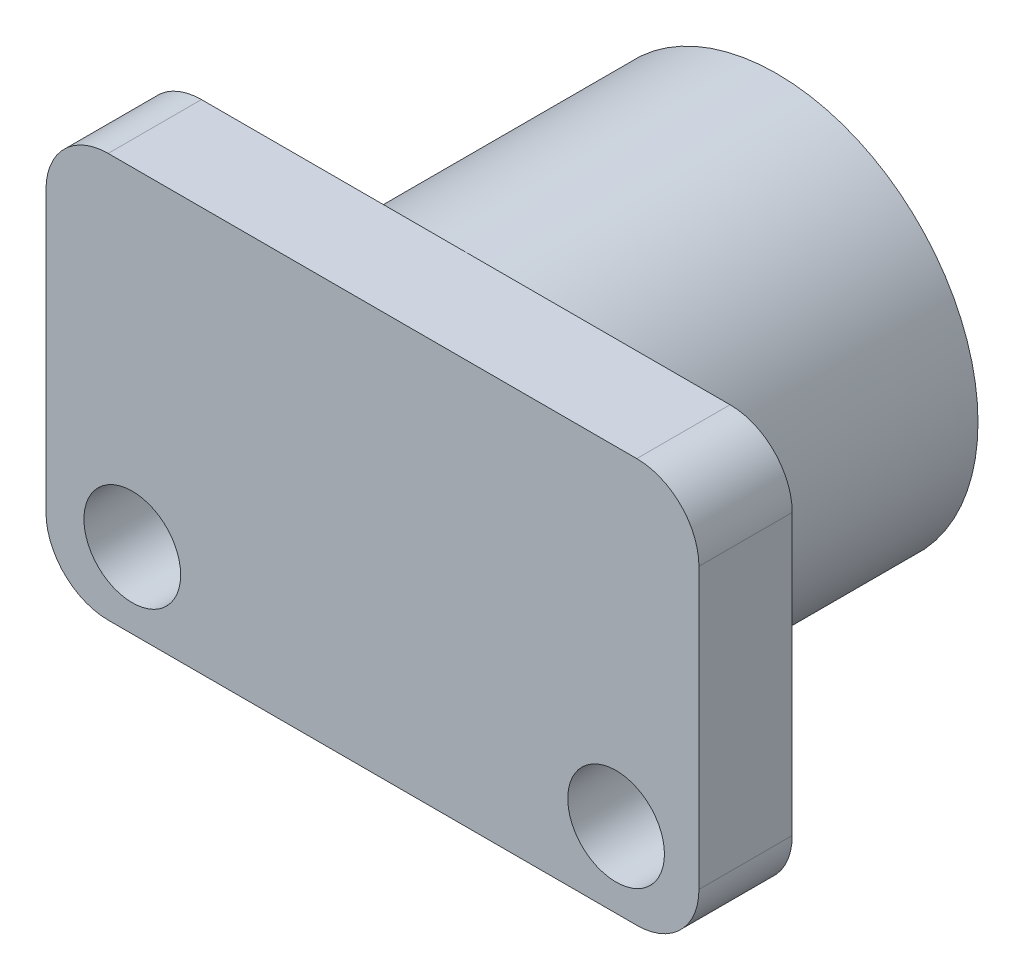
ISO-10303-21;
HEADER;
FILE_DESCRIPTION(('STEP AP214'),'2;1');
FILE_NAME('part.step','',(''),(''),'','','');
FILE_SCHEMA(('AUTOMOTIVE_DESIGN { 1 0 10303 214 1 1 1 1 }'));
ENDSEC;
DATA;
#1=APPLICATION_CONTEXT('core data for automotive mechanical design processes');
#2=APPLICATION_PROTOCOL_DEFINITION('international standard','automotive_design',2000,#1);
#3=PRODUCT_CONTEXT('',#1,'mechanical');
#4=PRODUCT('Part','Part','',(#3));
#5=PRODUCT_RELATED_PRODUCT_CATEGORY('part','',(#4));
#6=PRODUCT_DEFINITION_FORMATION('','',#4);
#7=PRODUCT_DEFINITION_CONTEXT('part definition',#1,'design');
#8=PRODUCT_DEFINITION('design','',#6,#7);
#9=PRODUCT_DEFINITION_SHAPE('','',#8);
#10=(LENGTH_UNIT() NAMED_UNIT(*) SI_UNIT(.MILLI.,.METRE.));
#11=(NAMED_UNIT(*) PLANE_ANGLE_UNIT() SI_UNIT($,.RADIAN.));
#12=(NAMED_UNIT(*) SI_UNIT($,.STERADIAN.) SOLID_ANGLE_UNIT());
#13=UNCERTAINTY_MEASURE_WITH_UNIT(LENGTH_MEASURE(1.E-05),#10,'distance_accuracy_value','');
#14=(GEOMETRIC_REPRESENTATION_CONTEXT(3) GLOBAL_UNCERTAINTY_ASSIGNED_CONTEXT((#13)) GLOBAL_UNIT_ASSIGNED_CONTEXT((#10,
#11,#12)) REPRESENTATION_CONTEXT('',''));
#15=CARTESIAN_POINT('',(0.,0.,0.));
#16=DIRECTION('',(0.,0.,1.));
#17=DIRECTION('',(1.,0.,0.));
#18=AXIS2_PLACEMENT_3D('',#15,#16,#17);
#19=CARTESIAN_POINT('',(-10.5,-6.5,3.));
#20=DIRECTION('',(1.,0.,0.));
#21=DIRECTION('',(0.,0.,-1.));
#22=AXIS2_PLACEMENT_3D('',#19,#20,#21);
#23=PLANE('',#22);
#24=DIRECTION('',(0.,-1.,0.));
#25=VECTOR('',#24,1.);
#26=CARTESIAN_POINT('',(-10.5,-6.5,0.));
#27=LINE('',#26,#25);
#28=CARTESIAN_POINT('',(-10.5,4.5,0.));
#29=VERTEX_POINT('',#28);
#30=CARTESIAN_POINT('',(-10.5,-4.5,0.));
#31=VERTEX_POINT('',#30);
#32=EDGE_CURVE('E132',#29,#31,#27,.T.);
#33=ORIENTED_EDGE('',*,*,#32,.T.);
#34=DIRECTION('',(0.,0.,-1.));
#35=VECTOR('',#34,1.);
#36=CARTESIAN_POINT('',(-10.5,-4.5,3.));
#37=LINE('',#36,#35);
#38=CARTESIAN_POINT('',(-10.5,-4.5,3.));
#39=VERTEX_POINT('',#38);
#40=EDGE_CURVE('E110',#31,#39,#37,.F.);
#41=ORIENTED_EDGE('',*,*,#40,.T.);
#42=DIRECTION('',(0.,-1.,0.));
#43=VECTOR('',#42,1.);
#44=CARTESIAN_POINT('',(-10.5,-6.5,3.));
#45=LINE('',#44,#43);
#46=CARTESIAN_POINT('',(-10.5,4.5,3.));
#47=VERTEX_POINT('',#46);
#48=EDGE_CURVE('E142',#47,#39,#45,.T.);
#49=ORIENTED_EDGE('',*,*,#48,.F.);
#50=DIRECTION('',(0.,0.,-1.));
#51=VECTOR('',#50,1.);
#52=CARTESIAN_POINT('',(-10.5,4.5,3.));
#53=LINE('',#52,#51);
#54=EDGE_CURVE('E115',#47,#29,#53,.T.);
#55=ORIENTED_EDGE('',*,*,#54,.T.);
#56=EDGE_LOOP('',(#33,#41,#49,#55));
#57=FACE_BOUND('',#56,.T.);
#58=ADVANCED_FACE('F38',(#57),#23,.F.);
#59=CARTESIAN_POINT('',(10.5,-6.5,3.));
#60=DIRECTION('',(0.,1.,0.));
#61=DIRECTION('',(-1.,0.,0.));
#62=AXIS2_PLACEMENT_3D('',#59,#60,#61);
#63=PLANE('',#62);
#64=DIRECTION('',(1.,0.,0.));
#65=VECTOR('',#64,1.);
#66=CARTESIAN_POINT('',(10.5,-6.5,3.));
#67=LINE('',#66,#65);
#68=CARTESIAN_POINT('',(-8.49999999999999,-6.5,3.));
#69=VERTEX_POINT('',#68);
#70=CARTESIAN_POINT('',(8.5,-6.5,3.));
#71=VERTEX_POINT('',#70);
#72=EDGE_CURVE('E125',#69,#71,#67,.T.);
#73=ORIENTED_EDGE('',*,*,#72,.F.);
#74=DIRECTION('',(0.,0.,-1.));
#75=VECTOR('',#74,1.);
#76=CARTESIAN_POINT('',(-8.5,-6.5,3.));
#77=LINE('',#76,#75);
#78=CARTESIAN_POINT('',(-8.49999999999999,-6.5,0.));
#79=VERTEX_POINT('',#78);
#80=EDGE_CURVE('E109',#69,#79,#77,.T.);
#81=ORIENTED_EDGE('',*,*,#80,.T.);
#82=DIRECTION('',(1.,0.,0.));
#83=VECTOR('',#82,1.);
#84=CARTESIAN_POINT('',(10.5,-6.5,0.));
#85=LINE('',#84,#83);
#86=CARTESIAN_POINT('',(8.5,-6.5,0.));
#87=VERTEX_POINT('',#86);
#88=EDGE_CURVE('E122',#79,#87,#85,.T.);
#89=ORIENTED_EDGE('',*,*,#88,.T.);
#90=DIRECTION('',(0.,0.,-1.));
#91=VECTOR('',#90,1.);
#92=CARTESIAN_POINT('',(8.5,-6.5,3.));
#93=LINE('',#92,#91);
#94=EDGE_CURVE('E127',#87,#71,#93,.F.);
#95=ORIENTED_EDGE('',*,*,#94,.T.);
#96=EDGE_LOOP('',(#73,#81,#89,#95));
#97=FACE_BOUND('',#96,.T.);
#98=ADVANCED_FACE('F121',(#97),#63,.F.);
#99=CARTESIAN_POINT('',(10.5,-6.5,3.));
#100=DIRECTION('',(-1.,0.,0.));
#101=DIRECTION('',(0.,0.,1.));
#102=AXIS2_PLACEMENT_3D('',#99,#100,#101);
#103=PLANE('',#102);
#104=DIRECTION('',(0.,1.,0.));
#105=VECTOR('',#104,1.);
#106=CARTESIAN_POINT('',(10.5,-6.5,3.));
#107=LINE('',#106,#105);
#108=CARTESIAN_POINT('',(10.5,-4.5,3.));
#109=VERTEX_POINT('',#108);
#110=CARTESIAN_POINT('',(10.5,4.5,3.));
#111=VERTEX_POINT('',#110);
#112=EDGE_CURVE('E176',#109,#111,#107,.T.);
#113=ORIENTED_EDGE('',*,*,#112,.F.);
#114=DIRECTION('',(0.,0.,-1.));
#115=VECTOR('',#114,1.);
#116=CARTESIAN_POINT('',(10.5,-4.5,3.));
#117=LINE('',#116,#115);
#118=CARTESIAN_POINT('',(10.5,-4.5,0.));
#119=VERTEX_POINT('',#118);
#120=EDGE_CURVE('E161',#109,#119,#117,.T.);
#121=ORIENTED_EDGE('',*,*,#120,.T.);
#122=DIRECTION('',(0.,1.,0.));
#123=VECTOR('',#122,1.);
#124=CARTESIAN_POINT('',(10.5,-6.5,0.));
#125=LINE('',#124,#123);
#126=CARTESIAN_POINT('',(10.5,4.5,0.));
#127=VERTEX_POINT('',#126);
#128=EDGE_CURVE('E131',#119,#127,#125,.T.);
#129=ORIENTED_EDGE('',*,*,#128,.T.);
#130=DIRECTION('',(0.,0.,-1.));
#131=VECTOR('',#130,1.);
#132=CARTESIAN_POINT('',(10.5,4.5,3.));
#133=LINE('',#132,#131);
#134=EDGE_CURVE('E159',#127,#111,#133,.F.);
#135=ORIENTED_EDGE('',*,*,#134,.T.);
#136=EDGE_LOOP('',(#113,#121,#129,#135));
#137=FACE_BOUND('',#136,.T.);
#138=ADVANCED_FACE('F192',(#137),#103,.F.);
#139=CARTESIAN_POINT('',(10.5,6.5,3.));
#140=DIRECTION('',(0.,-1.,0.));
#141=DIRECTION('',(1.,0.,0.));
#142=AXIS2_PLACEMENT_3D('',#139,#140,#141);
#143=PLANE('',#142);
#144=DIRECTION('',(-1.,0.,0.));
#145=VECTOR('',#144,1.);
#146=CARTESIAN_POINT('',(10.5,6.5,3.));
#147=LINE('',#146,#145);
#148=CARTESIAN_POINT('',(8.5,6.5,3.));
#149=VERTEX_POINT('',#148);
#150=CARTESIAN_POINT('',(-8.49999999999999,6.5,3.));
#151=VERTEX_POINT('',#150);
#152=EDGE_CURVE('E143',#149,#151,#147,.T.);
#153=ORIENTED_EDGE('',*,*,#152,.F.);
#154=DIRECTION('',(0.,0.,-1.));
#155=VECTOR('',#154,1.);
#156=CARTESIAN_POINT('',(8.5,6.5,3.));
#157=LINE('',#156,#155);
#158=CARTESIAN_POINT('',(8.5,6.5,0.));
#159=VERTEX_POINT('',#158);
#160=EDGE_CURVE('E46',#149,#159,#157,.T.);
#161=ORIENTED_EDGE('',*,*,#160,.T.);
#162=DIRECTION('',(-1.,0.,0.));
#163=VECTOR('',#162,1.);
#164=CARTESIAN_POINT('',(10.5,6.5,0.));
#165=LINE('',#164,#163);
#166=CARTESIAN_POINT('',(-8.49999999999999,6.5,0.));
#167=VERTEX_POINT('',#166);
#168=EDGE_CURVE('E135',#159,#167,#165,.T.);
#169=ORIENTED_EDGE('',*,*,#168,.T.);
#170=DIRECTION('',(0.,0.,-1.));
#171=VECTOR('',#170,1.);
#172=CARTESIAN_POINT('',(-8.5,6.5,3.));
#173=LINE('',#172,#171);
#174=EDGE_CURVE('E53',#167,#151,#173,.F.);
#175=ORIENTED_EDGE('',*,*,#174,.T.);
#176=EDGE_LOOP('',(#153,#161,#169,#175));
#177=FACE_BOUND('',#176,.T.);
#178=ADVANCED_FACE('F167',(#177),#143,.F.);
#179=CARTESIAN_POINT('',(0.,0.,3.));
#180=DIRECTION('',(0.,0.,1.));
#181=DIRECTION('',(1.,0.,0.));
#182=AXIS2_PLACEMENT_3D('',#179,#180,#181);
#183=PLANE('',#182);
#184=CARTESIAN_POINT('',(-7.725,-4.07406947421162,3.));
#185=DIRECTION('',(0.,0.,1.));
#186=DIRECTION('',(1.,0.,0.));
#187=AXIS2_PLACEMENT_3D('',#184,#185,#186);
#188=CIRCLE('',#187,1.555);
#189=CARTESIAN_POINT('',(-6.17,-4.07406947421162,3.));
#190=VERTEX_POINT('',#189);
#191=EDGE_CURVE('E337',#190,#190,#188,.T.);
#192=ORIENTED_EDGE('',*,*,#191,.F.);
#193=EDGE_LOOP('',(#192));
#194=FACE_BOUND('',#193,.T.);
#195=CARTESIAN_POINT('',(7.835,-4.07406947421162,3.));
#196=DIRECTION('',(0.,0.,1.));
#197=DIRECTION('',(1.,0.,0.));
#198=AXIS2_PLACEMENT_3D('',#195,#196,#197);
#199=CIRCLE('',#198,1.555);
#200=CARTESIAN_POINT('',(9.39,-4.07406947421162,3.));
#201=VERTEX_POINT('',#200);
#202=EDGE_CURVE('E179',#201,#201,#199,.T.);
#203=ORIENTED_EDGE('',*,*,#202,.F.);
#204=EDGE_LOOP('',(#203));
#205=FACE_BOUND('',#204,.T.);
#206=ORIENTED_EDGE('',*,*,#48,.T.);
#207=CARTESIAN_POINT('',(-8.5,-4.5,3.));
#208=DIRECTION('',(0.,0.,1.));
#209=DIRECTION('',(1.,0.,0.));
#210=AXIS2_PLACEMENT_3D('',#207,#208,#209);
#211=CIRCLE('',#210,2.);
#212=EDGE_CURVE('E157',#39,#69,#211,.T.);
#213=ORIENTED_EDGE('',*,*,#212,.T.);
#214=ORIENTED_EDGE('',*,*,#72,.T.);
#215=CARTESIAN_POINT('',(8.5,-4.5,3.));
#216=DIRECTION('',(0.,0.,1.));
#217=DIRECTION('',(1.,0.,0.));
#218=AXIS2_PLACEMENT_3D('',#215,#216,#217);
#219=CIRCLE('',#218,2.);
#220=EDGE_CURVE('E155',#71,#109,#219,.T.);
#221=ORIENTED_EDGE('',*,*,#220,.T.);
#222=ORIENTED_EDGE('',*,*,#112,.T.);
#223=CARTESIAN_POINT('',(8.5,4.5,3.));
#224=DIRECTION('',(0.,0.,1.));
#225=DIRECTION('',(1.,0.,0.));
#226=AXIS2_PLACEMENT_3D('',#223,#224,#225);
#227=CIRCLE('',#226,2.);
#228=EDGE_CURVE('E60',#111,#149,#227,.T.);
#229=ORIENTED_EDGE('',*,*,#228,.T.);
#230=ORIENTED_EDGE('',*,*,#152,.T.);
#231=CARTESIAN_POINT('',(-8.5,4.5,3.));
#232=DIRECTION('',(0.,0.,1.));
#233=DIRECTION('',(1.,0.,0.));
#234=AXIS2_PLACEMENT_3D('',#231,#232,#233);
#235=CIRCLE('',#234,2.);
#236=EDGE_CURVE('E152',#151,#47,#235,.T.);
#237=ORIENTED_EDGE('',*,*,#236,.T.);
#238=EDGE_LOOP('',(#206,#213,#214,#221,#222,#229,#230,#237));
#239=FACE_BOUND('',#238,.T.);
#240=ADVANCED_FACE('F182',(#194,#205,#239),#183,.T.);
#241=CARTESIAN_POINT('',(0.,0.,0.));
#242=DIRECTION('',(0.,0.,1.));
#243=DIRECTION('',(1.,0.,0.));
#244=AXIS2_PLACEMENT_3D('',#241,#242,#243);
#245=PLANE('',#244);
#246=CARTESIAN_POINT('',(0.,0.,0.));
#247=DIRECTION('',(0.,0.,1.));
#248=DIRECTION('',(1.,0.,0.));
#249=AXIS2_PLACEMENT_3D('',#246,#247,#248);
#250=CIRCLE('',#249,6.475);
#251=CARTESIAN_POINT('',(6.475,0.,0.));
#252=VERTEX_POINT('',#251);
#253=EDGE_CURVE('E11',#252,#252,#250,.F.);
#254=ORIENTED_EDGE('',*,*,#253,.F.);
#255=EDGE_LOOP('',(#254));
#256=FACE_BOUND('',#255,.T.);
#257=CARTESIAN_POINT('',(-7.725,-4.07406947421162,0.));
#258=DIRECTION('',(0.,0.,1.));
#259=DIRECTION('',(1.,0.,0.));
#260=AXIS2_PLACEMENT_3D('',#257,#258,#259);
#261=CIRCLE('',#260,1.555);
#262=CARTESIAN_POINT('',(-6.17,-4.07406947421162,0.));
#263=VERTEX_POINT('',#262);
#264=EDGE_CURVE('E137',#263,#263,#261,.T.);
#265=ORIENTED_EDGE('',*,*,#264,.T.);
#266=EDGE_LOOP('',(#265));
#267=FACE_BOUND('',#266,.T.);
#268=CARTESIAN_POINT('',(7.835,-4.07406947421162,0.));
#269=DIRECTION('',(0.,0.,1.));
#270=DIRECTION('',(1.,0.,0.));
#271=AXIS2_PLACEMENT_3D('',#268,#269,#270);
#272=CIRCLE('',#271,1.555);
#273=CARTESIAN_POINT('',(9.39,-4.07406947421162,0.));
#274=VERTEX_POINT('',#273);
#275=EDGE_CURVE('E339',#274,#274,#272,.T.);
#276=ORIENTED_EDGE('',*,*,#275,.T.);
#277=EDGE_LOOP('',(#276));
#278=FACE_BOUND('',#277,.T.);
#279=ORIENTED_EDGE('',*,*,#88,.F.);
#280=CARTESIAN_POINT('',(-8.5,-4.5,0.));
#281=DIRECTION('',(0.,0.,1.));
#282=DIRECTION('',(1.,0.,0.));
#283=AXIS2_PLACEMENT_3D('',#280,#281,#282);
#284=CIRCLE('',#283,2.);
#285=EDGE_CURVE('E105',#79,#31,#284,.F.);
#286=ORIENTED_EDGE('',*,*,#285,.T.);
#287=ORIENTED_EDGE('',*,*,#32,.F.);
#288=CARTESIAN_POINT('',(-8.5,4.5,0.));
#289=DIRECTION('',(0.,0.,1.));
#290=DIRECTION('',(1.,0.,0.));
#291=AXIS2_PLACEMENT_3D('',#288,#289,#290);
#292=CIRCLE('',#291,2.);
#293=EDGE_CURVE('E126',#29,#167,#292,.F.);
#294=ORIENTED_EDGE('',*,*,#293,.T.);
#295=ORIENTED_EDGE('',*,*,#168,.F.);
#296=CARTESIAN_POINT('',(8.5,4.5,0.));
#297=DIRECTION('',(0.,0.,1.));
#298=DIRECTION('',(1.,0.,0.));
#299=AXIS2_PLACEMENT_3D('',#296,#297,#298);
#300=CIRCLE('',#299,2.);
#301=EDGE_CURVE('E146',#159,#127,#300,.F.);
#302=ORIENTED_EDGE('',*,*,#301,.T.);
#303=ORIENTED_EDGE('',*,*,#128,.F.);
#304=CARTESIAN_POINT('',(8.5,-4.5,0.));
#305=DIRECTION('',(0.,0.,1.));
#306=DIRECTION('',(1.,0.,0.));
#307=AXIS2_PLACEMENT_3D('',#304,#305,#306);
#308=CIRCLE('',#307,2.);
#309=EDGE_CURVE('E116',#119,#87,#308,.F.);
#310=ORIENTED_EDGE('',*,*,#309,.T.);
#311=EDGE_LOOP('',(#279,#286,#287,#294,#295,#302,#303,#310));
#312=FACE_BOUND('',#311,.T.);
#313=ADVANCED_FACE('F129',(#256,#267,#278,#312),#245,.F.);
#314=CARTESIAN_POINT('',(-8.5,-4.5,3.));
#315=DIRECTION('',(0.,0.,-1.));
#316=DIRECTION('',(-1.,0.,0.));
#317=AXIS2_PLACEMENT_3D('',#314,#315,#316);
#318=CYLINDRICAL_SURFACE('',#317,2.);
#319=ORIENTED_EDGE('',*,*,#212,.F.);
#320=ORIENTED_EDGE('',*,*,#40,.F.);
#321=ORIENTED_EDGE('',*,*,#285,.F.);
#322=ORIENTED_EDGE('',*,*,#80,.F.);
#323=EDGE_LOOP('',(#319,#320,#321,#322));
#324=FACE_BOUND('',#323,.T.);
#325=ADVANCED_FACE('F108',(#324),#318,.T.);
#326=CARTESIAN_POINT('',(8.5,-4.5,3.));
#327=DIRECTION('',(0.,0.,-1.));
#328=DIRECTION('',(-1.,0.,0.));
#329=AXIS2_PLACEMENT_3D('',#326,#327,#328);
#330=CYLINDRICAL_SURFACE('',#329,2.);
#331=ORIENTED_EDGE('',*,*,#220,.F.);
#332=ORIENTED_EDGE('',*,*,#94,.F.);
#333=ORIENTED_EDGE('',*,*,#309,.F.);
#334=ORIENTED_EDGE('',*,*,#120,.F.);
#335=EDGE_LOOP('',(#331,#332,#333,#334));
#336=FACE_BOUND('',#335,.T.);
#337=ADVANCED_FACE('F207',(#336),#330,.T.);
#338=CARTESIAN_POINT('',(8.5,4.5,3.));
#339=DIRECTION('',(0.,0.,-1.));
#340=DIRECTION('',(-1.,0.,0.));
#341=AXIS2_PLACEMENT_3D('',#338,#339,#340);
#342=CYLINDRICAL_SURFACE('',#341,2.);
#343=ORIENTED_EDGE('',*,*,#228,.F.);
#344=ORIENTED_EDGE('',*,*,#134,.F.);
#345=ORIENTED_EDGE('',*,*,#301,.F.);
#346=ORIENTED_EDGE('',*,*,#160,.F.);
#347=EDGE_LOOP('',(#343,#344,#345,#346));
#348=FACE_BOUND('',#347,.T.);
#349=ADVANCED_FACE('F209',(#348),#342,.T.);
#350=CARTESIAN_POINT('',(-8.5,4.5,3.));
#351=DIRECTION('',(0.,0.,-1.));
#352=DIRECTION('',(-1.,0.,0.));
#353=AXIS2_PLACEMENT_3D('',#350,#351,#352);
#354=CYLINDRICAL_SURFACE('',#353,2.);
#355=ORIENTED_EDGE('',*,*,#236,.F.);
#356=ORIENTED_EDGE('',*,*,#174,.F.);
#357=ORIENTED_EDGE('',*,*,#293,.F.);
#358=ORIENTED_EDGE('',*,*,#54,.F.);
#359=EDGE_LOOP('',(#355,#356,#357,#358));
#360=FACE_BOUND('',#359,.T.);
#361=ADVANCED_FACE('F40',(#360),#354,.T.);
#362=CARTESIAN_POINT('',(7.835,-4.07406947421162,0.));
#363=DIRECTION('',(0.,0.,1.));
#364=DIRECTION('',(1.,0.,0.));
#365=AXIS2_PLACEMENT_3D('',#362,#363,#364);
#366=CYLINDRICAL_SURFACE('',#365,1.555);
#367=ORIENTED_EDGE('',*,*,#275,.F.);
#368=EDGE_LOOP('',(#367));
#369=FACE_BOUND('',#368,.T.);
#370=ORIENTED_EDGE('',*,*,#202,.T.);
#371=EDGE_LOOP('',(#370));
#372=FACE_BOUND('',#371,.T.);
#373=ADVANCED_FACE('F215',(#369,#372),#366,.F.);
#374=CARTESIAN_POINT('',(-7.725,-4.07406947421162,0.));
#375=DIRECTION('',(0.,0.,1.));
#376=DIRECTION('',(1.,0.,0.));
#377=AXIS2_PLACEMENT_3D('',#374,#375,#376);
#378=CYLINDRICAL_SURFACE('',#377,1.555);
#379=ORIENTED_EDGE('',*,*,#264,.F.);
#380=EDGE_LOOP('',(#379));
#381=FACE_BOUND('',#380,.T.);
#382=ORIENTED_EDGE('',*,*,#191,.T.);
#383=EDGE_LOOP('',(#382));
#384=FACE_BOUND('',#383,.T.);
#385=ADVANCED_FACE('F266',(#381,#384),#378,.F.);
#386=CARTESIAN_POINT('',(0.,0.,-10.));
#387=DIRECTION('',(0.,0.,1.));
#388=DIRECTION('',(1.,0.,0.));
#389=AXIS2_PLACEMENT_3D('',#386,#387,#388);
#390=CYLINDRICAL_SURFACE('',#389,6.475);
#391=CARTESIAN_POINT('',(0.,0.,-10.));
#392=DIRECTION('',(0.,0.,-1.));
#393=DIRECTION('',(-1.,0.,0.));
#394=AXIS2_PLACEMENT_3D('',#391,#392,#393);
#395=CIRCLE('',#394,6.475);
#396=CARTESIAN_POINT('',(-6.475,0.,-10.));
#397=VERTEX_POINT('',#396);
#398=EDGE_CURVE('E327',#397,#397,#395,.T.);
#399=ORIENTED_EDGE('',*,*,#398,.F.);
#400=EDGE_LOOP('',(#399));
#401=FACE_BOUND('',#400,.T.);
#402=ORIENTED_EDGE('',*,*,#253,.T.);
#403=EDGE_LOOP('',(#402));
#404=FACE_BOUND('',#403,.T.);
#405=ADVANCED_FACE('F275',(#401,#404),#390,.T.);
#406=CARTESIAN_POINT('',(0.,0.,-10.));
#407=DIRECTION('',(0.,0.,-1.));
#408=DIRECTION('',(-1.,0.,0.));
#409=AXIS2_PLACEMENT_3D('',#406,#407,#408);
#410=PLANE('',#409);
#411=CARTESIAN_POINT('',(0.,0.,-10.));
#412=DIRECTION('',(0.,0.,-1.));
#413=DIRECTION('',(-1.,0.,0.));
#414=AXIS2_PLACEMENT_3D('',#411,#412,#413);
#415=CIRCLE('',#414,5.065);
#416=CARTESIAN_POINT('',(-5.065,0.,-10.));
#417=VERTEX_POINT('',#416);
#418=EDGE_CURVE('E328',#417,#417,#415,.T.);
#419=ORIENTED_EDGE('',*,*,#418,.F.);
#420=EDGE_LOOP('',(#419));
#421=FACE_BOUND('',#420,.T.);
#422=ORIENTED_EDGE('',*,*,#398,.T.);
#423=EDGE_LOOP('',(#422));
#424=FACE_BOUND('',#423,.T.);
#425=ADVANCED_FACE('F290',(#421,#424),#410,.T.);
#426=CARTESIAN_POINT('',(0.,0.,0.));
#427=DIRECTION('',(0.,0.,-1.));
#428=DIRECTION('',(-1.,0.,0.));
#429=AXIS2_PLACEMENT_3D('',#426,#427,#428);
#430=CYLINDRICAL_SURFACE('',#429,5.065);
#431=CARTESIAN_POINT('',(0.,0.,0.));
#432=DIRECTION('',(0.,0.,-1.));
#433=DIRECTION('',(-1.,0.,0.));
#434=AXIS2_PLACEMENT_3D('',#431,#432,#433);
#435=CIRCLE('',#434,5.065);
#436=CARTESIAN_POINT('',(-5.065,0.,0.));
#437=VERTEX_POINT('',#436);
#438=EDGE_CURVE('E326',#437,#437,#435,.T.);
#439=ORIENTED_EDGE('',*,*,#438,.F.);
#440=EDGE_LOOP('',(#439));
#441=FACE_BOUND('',#440,.T.);
#442=ORIENTED_EDGE('',*,*,#418,.T.);
#443=EDGE_LOOP('',(#442));
#444=FACE_BOUND('',#443,.T.);
#445=ADVANCED_FACE('F300',(#441,#444),#430,.F.);
#446=CARTESIAN_POINT('',(0.,0.,0.));
#447=DIRECTION('',(0.,0.,-1.));
#448=DIRECTION('',(-1.,0.,0.));
#449=AXIS2_PLACEMENT_3D('',#446,#447,#448);
#450=PLANE('',#449);
#451=ORIENTED_EDGE('',*,*,#438,.T.);
#452=EDGE_LOOP('',(#451));
#453=FACE_BOUND('',#452,.T.);
#454=ADVANCED_FACE('F310',(#453),#450,.T.);
#455=CLOSED_SHELL('',(#58,#98,#138,#178,#240,#313,#325,#337,#349,#361,#373,#385,#405,#425,#445,#454));
#456=MANIFOLD_SOLID_BREP('B2',#455);
#457=ADVANCED_BREP_SHAPE_REPRESENTATION('',(#18,#456),#14);
#458=SHAPE_DEFINITION_REPRESENTATION(#9,#457);
ENDSEC;
END-ISO-10303-21;
